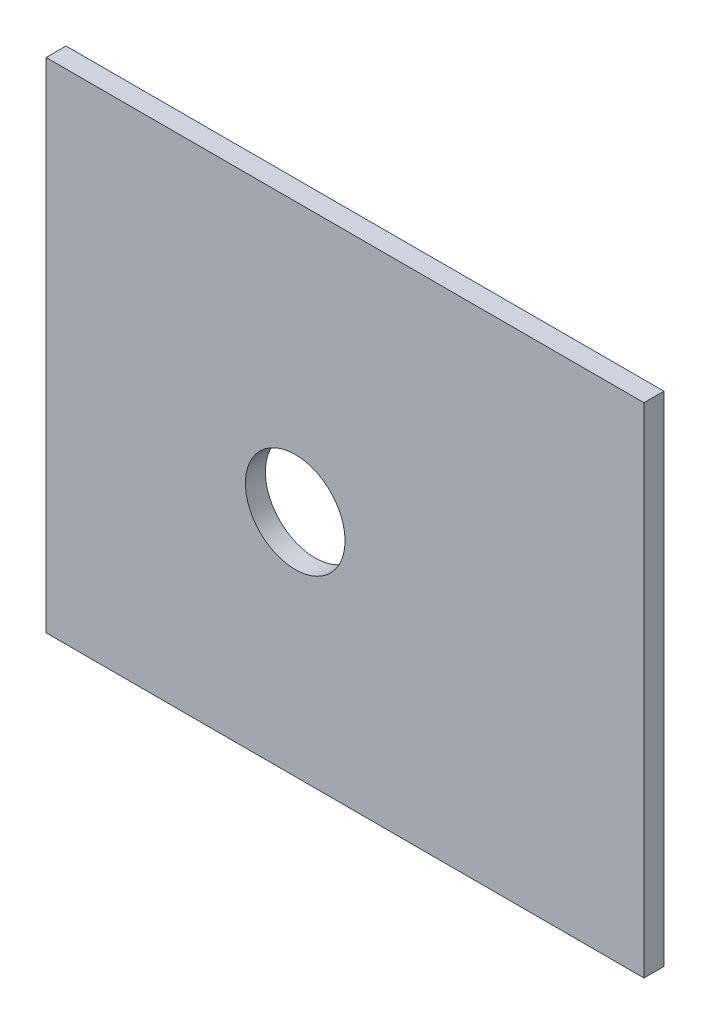
ISO-10303-21;
HEADER;
FILE_DESCRIPTION(('STEP AP214'),'2;1');
FILE_NAME('part.step','',(''),(''),'','','');
FILE_SCHEMA(('AUTOMOTIVE_DESIGN { 1 0 10303 214 1 1 1 1 }'));
ENDSEC;
DATA;
#1=APPLICATION_CONTEXT('core data for automotive mechanical design processes');
#2=APPLICATION_PROTOCOL_DEFINITION('international standard','automotive_design',2000,#1);
#3=PRODUCT_CONTEXT('',#1,'mechanical');
#4=PRODUCT('Part','Part','',(#3));
#5=PRODUCT_RELATED_PRODUCT_CATEGORY('part','',(#4));
#6=PRODUCT_DEFINITION_FORMATION('','',#4);
#7=PRODUCT_DEFINITION_CONTEXT('part definition',#1,'design');
#8=PRODUCT_DEFINITION('design','',#6,#7);
#9=PRODUCT_DEFINITION_SHAPE('','',#8);
#10=(LENGTH_UNIT() NAMED_UNIT(*) SI_UNIT(.MILLI.,.METRE.));
#11=(NAMED_UNIT(*) PLANE_ANGLE_UNIT() SI_UNIT($,.RADIAN.));
#12=(NAMED_UNIT(*) SI_UNIT($,.STERADIAN.) SOLID_ANGLE_UNIT());
#13=UNCERTAINTY_MEASURE_WITH_UNIT(LENGTH_MEASURE(1.E-05),#10,'distance_accuracy_value','');
#14=(GEOMETRIC_REPRESENTATION_CONTEXT(3) GLOBAL_UNCERTAINTY_ASSIGNED_CONTEXT((#13)) GLOBAL_UNIT_ASSIGNED_CONTEXT((#10,
#11,#12)) REPRESENTATION_CONTEXT('',''));
#15=CARTESIAN_POINT('',(0.,0.,0.));
#16=DIRECTION('',(0.,0.,1.));
#17=DIRECTION('',(1.,0.,0.));
#18=AXIS2_PLACEMENT_3D('',#15,#16,#17);
#19=CARTESIAN_POINT('',(0.,0.,2.));
#20=DIRECTION('',(0.,0.,1.));
#21=DIRECTION('',(1.,0.,0.));
#22=AXIS2_PLACEMENT_3D('',#19,#20,#21);
#23=PLANE('',#22);
#24=DIRECTION('',(0.,1.,0.));
#25=VECTOR('',#24,1.);
#26=CARTESIAN_POINT('',(30.,25.,2.));
#27=LINE('',#26,#25);
#28=CARTESIAN_POINT('',(30.,-25.,2.));
#29=VERTEX_POINT('',#28);
#30=CARTESIAN_POINT('',(30.,25.,2.));
#31=VERTEX_POINT('',#30);
#32=EDGE_CURVE('E87',#29,#31,#27,.T.);
#33=ORIENTED_EDGE('',*,*,#32,.T.);
#34=DIRECTION('',(-1.,0.,0.));
#35=VECTOR('',#34,1.);
#36=CARTESIAN_POINT('',(-30.,25.,2.));
#37=LINE('',#36,#35);
#38=CARTESIAN_POINT('',(-30.,25.,2.));
#39=VERTEX_POINT('',#38);
#40=EDGE_CURVE('E82',#31,#39,#37,.T.);
#41=ORIENTED_EDGE('',*,*,#40,.T.);
#42=DIRECTION('',(0.,-1.,0.));
#43=VECTOR('',#42,1.);
#44=CARTESIAN_POINT('',(-30.,25.,2.));
#45=LINE('',#44,#43);
#46=CARTESIAN_POINT('',(-30.,-25.,2.));
#47=VERTEX_POINT('',#46);
#48=EDGE_CURVE('E85',#39,#47,#45,.T.);
#49=ORIENTED_EDGE('',*,*,#48,.T.);
#50=DIRECTION('',(1.,0.,0.));
#51=VECTOR('',#50,1.);
#52=CARTESIAN_POINT('',(-30.,-25.,2.));
#53=LINE('',#52,#51);
#54=EDGE_CURVE('E52',#47,#29,#53,.T.);
#55=ORIENTED_EDGE('',*,*,#54,.T.);
#56=EDGE_LOOP('',(#33,#41,#49,#55));
#57=FACE_BOUND('',#56,.T.);
#58=CARTESIAN_POINT('',(-5.,-2.,2.));
#59=DIRECTION('',(0.,0.,1.));
#60=DIRECTION('',(1.,0.,0.));
#61=AXIS2_PLACEMENT_3D('',#58,#59,#60);
#62=CIRCLE('',#61,5.);
#63=CARTESIAN_POINT('',(0.,-2.,2.));
#64=VERTEX_POINT('',#63);
#65=EDGE_CURVE('E102',#64,#64,#62,.T.);
#66=ORIENTED_EDGE('',*,*,#65,.F.);
#67=EDGE_LOOP('',(#66));
#68=FACE_BOUND('',#67,.T.);
#69=ADVANCED_FACE('F35',(#57,#68),#23,.T.);
#70=CARTESIAN_POINT('',(0.,0.,0.));
#71=DIRECTION('',(0.,0.,1.));
#72=DIRECTION('',(1.,0.,0.));
#73=AXIS2_PLACEMENT_3D('',#70,#71,#72);
#74=PLANE('',#73);
#75=DIRECTION('',(0.,1.,0.));
#76=VECTOR('',#75,1.);
#77=CARTESIAN_POINT('',(30.,25.,0.));
#78=LINE('',#77,#76);
#79=CARTESIAN_POINT('',(30.,-25.,0.));
#80=VERTEX_POINT('',#79);
#81=CARTESIAN_POINT('',(30.,25.,0.));
#82=VERTEX_POINT('',#81);
#83=EDGE_CURVE('E99',#80,#82,#78,.T.);
#84=ORIENTED_EDGE('',*,*,#83,.F.);
#85=DIRECTION('',(1.,0.,0.));
#86=VECTOR('',#85,1.);
#87=CARTESIAN_POINT('',(-30.,-25.,0.));
#88=LINE('',#87,#86);
#89=CARTESIAN_POINT('',(-30.,-25.,0.));
#90=VERTEX_POINT('',#89);
#91=EDGE_CURVE('E75',#90,#80,#88,.T.);
#92=ORIENTED_EDGE('',*,*,#91,.F.);
#93=DIRECTION('',(0.,-1.,0.));
#94=VECTOR('',#93,1.);
#95=CARTESIAN_POINT('',(-30.,25.,0.));
#96=LINE('',#95,#94);
#97=CARTESIAN_POINT('',(-30.,25.,0.));
#98=VERTEX_POINT('',#97);
#99=EDGE_CURVE('E69',#98,#90,#96,.T.);
#100=ORIENTED_EDGE('',*,*,#99,.F.);
#101=DIRECTION('',(-1.,0.,0.));
#102=VECTOR('',#101,1.);
#103=CARTESIAN_POINT('',(-30.,25.,0.));
#104=LINE('',#103,#102);
#105=EDGE_CURVE('E91',#82,#98,#104,.T.);
#106=ORIENTED_EDGE('',*,*,#105,.F.);
#107=EDGE_LOOP('',(#84,#92,#100,#106));
#108=FACE_BOUND('',#107,.T.);
#109=CARTESIAN_POINT('',(-5.,-2.,0.));
#110=DIRECTION('',(0.,0.,1.));
#111=DIRECTION('',(1.,0.,0.));
#112=AXIS2_PLACEMENT_3D('',#109,#110,#111);
#113=CIRCLE('',#112,5.);
#114=CARTESIAN_POINT('',(0.,-2.,0.));
#115=VERTEX_POINT('',#114);
#116=EDGE_CURVE('E114',#115,#115,#113,.T.);
#117=ORIENTED_EDGE('',*,*,#116,.T.);
#118=EDGE_LOOP('',(#117));
#119=FACE_BOUND('',#118,.T.);
#120=ADVANCED_FACE('F110',(#108,#119),#74,.F.);
#121=CARTESIAN_POINT('',(30.,25.,2.));
#122=DIRECTION('',(-1.,0.,0.));
#123=DIRECTION('',(0.,-1.,0.));
#124=AXIS2_PLACEMENT_3D('',#121,#122,#123);
#125=PLANE('',#124);
#126=ORIENTED_EDGE('',*,*,#83,.T.);
#127=DIRECTION('',(0.,0.,-1.));
#128=VECTOR('',#127,1.);
#129=CARTESIAN_POINT('',(30.,25.,2.));
#130=LINE('',#129,#128);
#131=EDGE_CURVE('E11',#31,#82,#130,.T.);
#132=ORIENTED_EDGE('',*,*,#131,.F.);
#133=ORIENTED_EDGE('',*,*,#32,.F.);
#134=DIRECTION('',(0.,0.,-1.));
#135=VECTOR('',#134,1.);
#136=CARTESIAN_POINT('',(30.,-25.,2.));
#137=LINE('',#136,#135);
#138=EDGE_CURVE('E95',#29,#80,#137,.T.);
#139=ORIENTED_EDGE('',*,*,#138,.T.);
#140=EDGE_LOOP('',(#126,#132,#133,#139));
#141=FACE_BOUND('',#140,.T.);
#142=ADVANCED_FACE('F37',(#141),#125,.F.);
#143=CARTESIAN_POINT('',(-30.,25.,2.));
#144=DIRECTION('',(0.,-1.,0.));
#145=DIRECTION('',(0.,0.,-1.));
#146=AXIS2_PLACEMENT_3D('',#143,#144,#145);
#147=PLANE('',#146);
#148=ORIENTED_EDGE('',*,*,#105,.T.);
#149=DIRECTION('',(0.,0.,-1.));
#150=VECTOR('',#149,1.);
#151=CARTESIAN_POINT('',(-30.,25.,2.));
#152=LINE('',#151,#150);
#153=EDGE_CURVE('E44',#39,#98,#152,.T.);
#154=ORIENTED_EDGE('',*,*,#153,.F.);
#155=ORIENTED_EDGE('',*,*,#40,.F.);
#156=ORIENTED_EDGE('',*,*,#131,.T.);
#157=EDGE_LOOP('',(#148,#154,#155,#156));
#158=FACE_BOUND('',#157,.T.);
#159=ADVANCED_FACE('F90',(#158),#147,.F.);
#160=CARTESIAN_POINT('',(-30.,25.,2.));
#161=DIRECTION('',(1.,0.,0.));
#162=DIRECTION('',(0.,1.,0.));
#163=AXIS2_PLACEMENT_3D('',#160,#161,#162);
#164=PLANE('',#163);
#165=ORIENTED_EDGE('',*,*,#99,.T.);
#166=DIRECTION('',(0.,0.,-1.));
#167=VECTOR('',#166,1.);
#168=CARTESIAN_POINT('',(-30.,-25.,2.));
#169=LINE('',#168,#167);
#170=EDGE_CURVE('E92',#47,#90,#169,.T.);
#171=ORIENTED_EDGE('',*,*,#170,.F.);
#172=ORIENTED_EDGE('',*,*,#48,.F.);
#173=ORIENTED_EDGE('',*,*,#153,.T.);
#174=EDGE_LOOP('',(#165,#171,#172,#173));
#175=FACE_BOUND('',#174,.T.);
#176=ADVANCED_FACE('F93',(#175),#164,.F.);
#177=CARTESIAN_POINT('',(-30.,-25.,2.));
#178=DIRECTION('',(0.,1.,0.));
#179=DIRECTION('',(0.,0.,1.));
#180=AXIS2_PLACEMENT_3D('',#177,#178,#179);
#181=PLANE('',#180);
#182=ORIENTED_EDGE('',*,*,#91,.T.);
#183=ORIENTED_EDGE('',*,*,#138,.F.);
#184=ORIENTED_EDGE('',*,*,#54,.F.);
#185=ORIENTED_EDGE('',*,*,#170,.T.);
#186=EDGE_LOOP('',(#182,#183,#184,#185));
#187=FACE_BOUND('',#186,.T.);
#188=ADVANCED_FACE('F107',(#187),#181,.F.);
#189=CARTESIAN_POINT('',(-5.,-2.,2.));
#190=DIRECTION('',(0.,0.,-1.));
#191=DIRECTION('',(-1.,0.,0.));
#192=AXIS2_PLACEMENT_3D('',#189,#190,#191);
#193=CYLINDRICAL_SURFACE('',#192,5.);
#194=ORIENTED_EDGE('',*,*,#65,.T.);
#195=EDGE_LOOP('',(#194));
#196=FACE_BOUND('',#195,.T.);
#197=ORIENTED_EDGE('',*,*,#116,.F.);
#198=EDGE_LOOP('',(#197));
#199=FACE_BOUND('',#198,.T.);
#200=ADVANCED_FACE('F120',(#196,#199),#193,.F.);
#201=CLOSED_SHELL('',(#69,#120,#142,#159,#176,#188,#200));
#202=MANIFOLD_SOLID_BREP('B2',#201);
#203=ADVANCED_BREP_SHAPE_REPRESENTATION('',(#18,#202),#14);
#204=SHAPE_DEFINITION_REPRESENTATION(#9,#203);
ENDSEC;
END-ISO-10303-21;
